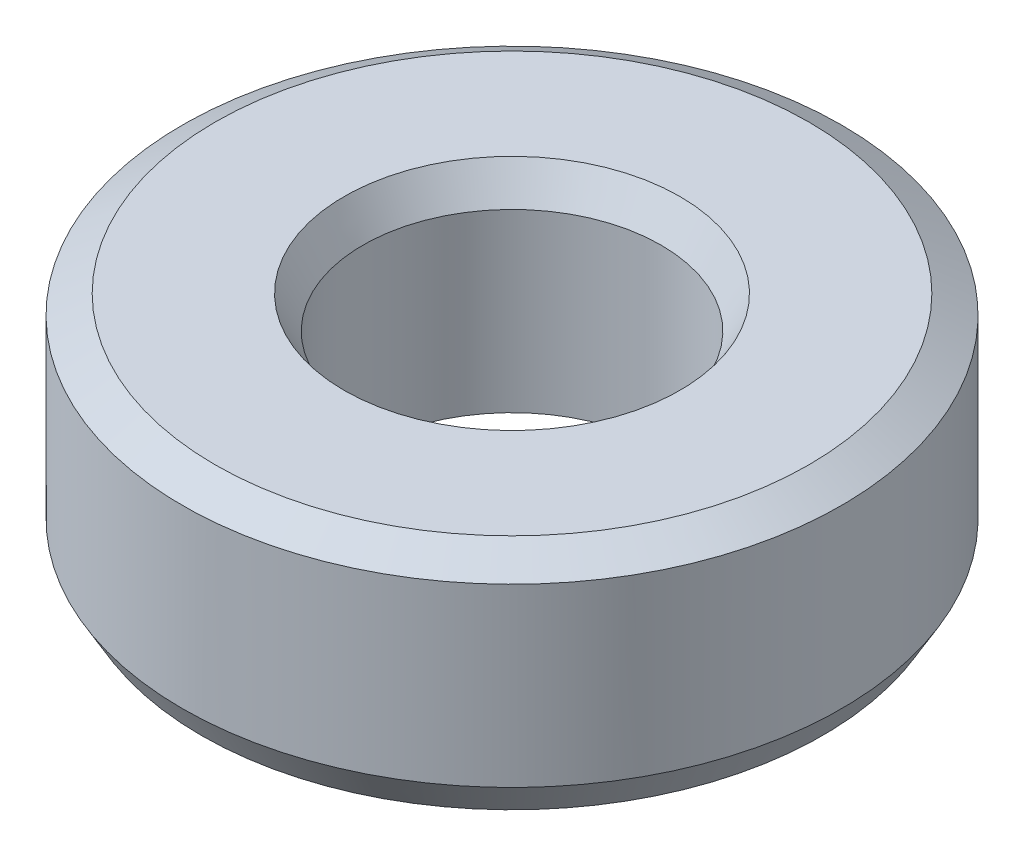
ISO-10303-21;
HEADER;
FILE_DESCRIPTION(('STEP AP214'),'2;1');
FILE_NAME('part.step','',(''),(''),'','','');
FILE_SCHEMA(('AUTOMOTIVE_DESIGN { 1 0 10303 214 1 1 1 1 }'));
ENDSEC;
DATA;
#1=APPLICATION_CONTEXT('core data for automotive mechanical design processes');
#2=APPLICATION_PROTOCOL_DEFINITION('international standard','automotive_design',2000,#1);
#3=PRODUCT_CONTEXT('',#1,'mechanical');
#4=PRODUCT('Part','Part','',(#3));
#5=PRODUCT_RELATED_PRODUCT_CATEGORY('part','',(#4));
#6=PRODUCT_DEFINITION_FORMATION('','',#4);
#7=PRODUCT_DEFINITION_CONTEXT('part definition',#1,'design');
#8=PRODUCT_DEFINITION('design','',#6,#7);
#9=PRODUCT_DEFINITION_SHAPE('','',#8);
#10=(LENGTH_UNIT() NAMED_UNIT(*) SI_UNIT(.MILLI.,.METRE.));
#11=(NAMED_UNIT(*) PLANE_ANGLE_UNIT() SI_UNIT($,.RADIAN.));
#12=(NAMED_UNIT(*) SI_UNIT($,.STERADIAN.) SOLID_ANGLE_UNIT());
#13=UNCERTAINTY_MEASURE_WITH_UNIT(LENGTH_MEASURE(1.E-05),#10,'distance_accuracy_value','');
#14=(GEOMETRIC_REPRESENTATION_CONTEXT(3) GLOBAL_UNCERTAINTY_ASSIGNED_CONTEXT((#13)) GLOBAL_UNIT_ASSIGNED_CONTEXT((#10,
#11,#12)) REPRESENTATION_CONTEXT('',''));
#15=CARTESIAN_POINT('',(0.,0.,0.));
#16=DIRECTION('',(0.,0.,1.));
#17=DIRECTION('',(1.,0.,0.));
#18=AXIS2_PLACEMENT_3D('',#15,#16,#17);
#19=CARTESIAN_POINT('',(0.,31.0685685898824,0.));
#20=DIRECTION('',(0.,-1.,0.));
#21=DIRECTION('',(0.,0.,-1.));
#22=AXIS2_PLACEMENT_3D('',#19,#20,#21);
#23=CYLINDRICAL_SURFACE('',#22,45.);
#24=CARTESIAN_POINT('',(0.,4.45937553818092,0.));
#25=DIRECTION('',(0.,1.,0.));
#26=DIRECTION('',(0.,0.,1.));
#27=AXIS2_PLACEMENT_3D('',#24,#25,#26);
#28=CIRCLE('',#27,45.);
#29=CARTESIAN_POINT('',(0.,4.45937553818092,45.));
#30=VERTEX_POINT('',#29);
#31=EDGE_CURVE('E10',#30,#30,#28,.T.);
#32=ORIENTED_EDGE('',*,*,#31,.T.);
#33=EDGE_LOOP('',(#32));
#34=FACE_BOUND('',#33,.T.);
#35=CARTESIAN_POINT('',(0.,28.493946922496,0.));
#36=DIRECTION('',(0.,1.,0.));
#37=DIRECTION('',(0.,0.,1.));
#38=AXIS2_PLACEMENT_3D('',#35,#36,#37);
#39=CIRCLE('',#38,45.);
#40=CARTESIAN_POINT('',(0.,28.493946922496,-45.));
#41=VERTEX_POINT('',#40);
#42=EDGE_CURVE('E50',#41,#41,#39,.F.);
#43=ORIENTED_EDGE('',*,*,#42,.T.);
#44=EDGE_LOOP('',(#43));
#45=FACE_BOUND('',#44,.T.);
#46=ADVANCED_FACE('F39',(#34,#45),#23,.T.);
#47=CARTESIAN_POINT('',(0.,31.0685685898824,0.));
#48=DIRECTION('',(0.,1.,0.));
#49=DIRECTION('',(0.,0.,1.));
#50=AXIS2_PLACEMENT_3D('',#47,#48,#49);
#51=PLANE('',#50);
#52=CARTESIAN_POINT('',(0.,31.0685685898824,0.));
#53=DIRECTION('',(0.,1.,0.));
#54=DIRECTION('',(0.,0.,1.));
#55=AXIS2_PLACEMENT_3D('',#52,#53,#54);
#56=CIRCLE('',#55,22.9311606808608);
#57=CARTESIAN_POINT('',(0.,31.0685685898824,22.9311606808608));
#58=VERTEX_POINT('',#57);
#59=EDGE_CURVE('E58',#58,#58,#56,.F.);
#60=ORIENTED_EDGE('',*,*,#59,.T.);
#61=EDGE_LOOP('',(#60));
#62=FACE_BOUND('',#61,.T.);
#63=CARTESIAN_POINT('',(0.,31.0685685898824,0.));
#64=DIRECTION('',(0.,1.,0.));
#65=DIRECTION('',(0.,0.,1.));
#66=AXIS2_PLACEMENT_3D('',#63,#64,#65);
#67=CIRCLE('',#66,40.540624461819);
#68=CARTESIAN_POINT('',(0.,31.0685685898824,-40.540624461819));
#69=VERTEX_POINT('',#68);
#70=EDGE_CURVE('E61',#69,#69,#67,.T.);
#71=ORIENTED_EDGE('',*,*,#70,.T.);
#72=EDGE_LOOP('',(#71));
#73=FACE_BOUND('',#72,.T.);
#74=ADVANCED_FACE('F88',(#62,#73),#51,.T.);
#75=CARTESIAN_POINT('',(0.,0.,0.));
#76=DIRECTION('',(0.,1.,0.));
#77=DIRECTION('',(0.,0.,1.));
#78=AXIS2_PLACEMENT_3D('',#75,#76,#77);
#79=PLANE('',#78);
#80=CARTESIAN_POINT('',(0.,0.,0.));
#81=DIRECTION('',(0.,1.,0.));
#82=DIRECTION('',(0.,0.,1.));
#83=AXIS2_PLACEMENT_3D('',#80,#81,#82);
#84=CIRCLE('',#83,24.8159145516553);
#85=CARTESIAN_POINT('',(0.,0.,24.8159145516553));
#86=VERTEX_POINT('',#85);
#87=EDGE_CURVE('E51',#86,#86,#84,.T.);
#88=ORIENTED_EDGE('',*,*,#87,.T.);
#89=EDGE_LOOP('',(#88));
#90=FACE_BOUND('',#89,.T.);
#91=CARTESIAN_POINT('',(0.,0.,0.));
#92=DIRECTION('',(0.,1.,0.));
#93=DIRECTION('',(0.,0.,1.));
#94=AXIS2_PLACEMENT_3D('',#91,#92,#93);
#95=CIRCLE('',#94,42.4253783326136);
#96=CARTESIAN_POINT('',(0.,0.,42.4253783326136));
#97=VERTEX_POINT('',#96);
#98=EDGE_CURVE('E54',#97,#97,#95,.F.);
#99=ORIENTED_EDGE('',*,*,#98,.T.);
#100=EDGE_LOOP('',(#99));
#101=FACE_BOUND('',#100,.T.);
#102=ADVANCED_FACE('F83',(#90,#101),#79,.F.);
#103=CARTESIAN_POINT('',(0.,31.0685685898824,0.));
#104=DIRECTION('',(0.,-1.,0.));
#105=DIRECTION('',(0.,0.,-1.));
#106=AXIS2_PLACEMENT_3D('',#103,#104,#105);
#107=CYLINDRICAL_SURFACE('',#106,20.3565390134744);
#108=CARTESIAN_POINT('',(0.,26.6091930517014,0.));
#109=DIRECTION('',(0.,1.,0.));
#110=DIRECTION('',(0.,0.,1.));
#111=AXIS2_PLACEMENT_3D('',#108,#109,#110);
#112=CIRCLE('',#111,20.3565390134744);
#113=CARTESIAN_POINT('',(0.,26.6091930517014,20.3565390134744));
#114=VERTEX_POINT('',#113);
#115=EDGE_CURVE('E67',#114,#114,#112,.T.);
#116=ORIENTED_EDGE('',*,*,#115,.T.);
#117=EDGE_LOOP('',(#116));
#118=FACE_BOUND('',#117,.T.);
#119=CARTESIAN_POINT('',(0.,2.57462166738643,0.));
#120=DIRECTION('',(0.,1.,0.));
#121=DIRECTION('',(0.,0.,1.));
#122=AXIS2_PLACEMENT_3D('',#119,#120,#121);
#123=CIRCLE('',#122,20.3565390134744);
#124=CARTESIAN_POINT('',(0.,2.57462166738643,20.3565390134744));
#125=VERTEX_POINT('',#124);
#126=EDGE_CURVE('E69',#125,#125,#123,.F.);
#127=ORIENTED_EDGE('',*,*,#126,.T.);
#128=EDGE_LOOP('',(#127));
#129=FACE_BOUND('',#128,.T.);
#130=ADVANCED_FACE('F71',(#118,#129),#107,.F.);
#131=CARTESIAN_POINT('',(0.,26.6091930517014,0.));
#132=DIRECTION('',(0.,1.,0.));
#133=DIRECTION('',(0.,0.,1.));
#134=AXIS2_PLACEMENT_3D('',#131,#132,#133);
#135=CONICAL_SURFACE('',#134,20.3565390134744,0.523598775598303);
#136=ORIENTED_EDGE('',*,*,#59,.F.);
#137=EDGE_LOOP('',(#136));
#138=FACE_BOUND('',#137,.T.);
#139=ORIENTED_EDGE('',*,*,#115,.F.);
#140=EDGE_LOOP('',(#139));
#141=FACE_BOUND('',#140,.T.);
#142=ADVANCED_FACE('F77',(#138,#141),#135,.F.);
#143=CARTESIAN_POINT('',(0.,0.,0.));
#144=DIRECTION('',(0.,-1.,0.));
#145=DIRECTION('',(0.,0.,-1.));
#146=AXIS2_PLACEMENT_3D('',#143,#144,#145);
#147=CONICAL_SURFACE('',#146,24.8159145516553,1.0471975511966);
#148=ORIENTED_EDGE('',*,*,#126,.F.);
#149=EDGE_LOOP('',(#148));
#150=FACE_BOUND('',#149,.T.);
#151=ORIENTED_EDGE('',*,*,#87,.F.);
#152=EDGE_LOOP('',(#151));
#153=FACE_BOUND('',#152,.T.);
#154=ADVANCED_FACE('F73',(#150,#153),#147,.F.);
#155=CARTESIAN_POINT('',(0.,4.45937553818092,0.));
#156=DIRECTION('',(0.,1.,0.));
#157=DIRECTION('',(0.,0.,1.));
#158=AXIS2_PLACEMENT_3D('',#155,#156,#157);
#159=CONICAL_SURFACE('',#158,45.,0.523598775598305);
#160=ORIENTED_EDGE('',*,*,#98,.F.);
#161=EDGE_LOOP('',(#160));
#162=FACE_BOUND('',#161,.T.);
#163=ORIENTED_EDGE('',*,*,#31,.F.);
#164=EDGE_LOOP('',(#163));
#165=FACE_BOUND('',#164,.T.);
#166=ADVANCED_FACE('F76',(#162,#165),#159,.T.);
#167=CARTESIAN_POINT('',(0.,31.0685685898824,0.));
#168=DIRECTION('',(0.,-1.,0.));
#169=DIRECTION('',(0.,0.,-1.));
#170=AXIS2_PLACEMENT_3D('',#167,#168,#169);
#171=CONICAL_SURFACE('',#170,40.540624461819,1.04719755119659);
#172=CARTESIAN_POINT('',(0.,28.493946922496,-45.));
#173=CARTESIAN_POINT('',(0.,28.5207658981979,-44.9535481714773));
#174=CARTESIAN_POINT('',(0.,28.5475848738998,-44.9070963429546));
#175=CARTESIAN_POINT('',(0.,28.6012228253037,-44.8141926859091));
#176=CARTESIAN_POINT('',(0.,28.6280418010057,-44.7677408573864));
#177=CARTESIAN_POINT('',(0.,28.6816797524096,-44.674837200341));
#178=CARTESIAN_POINT('',(0.,28.7084987281115,-44.6283853718183));
#179=CARTESIAN_POINT('',(0.,28.7621366795154,-44.5354817147728));
#180=CARTESIAN_POINT('',(0.,28.7889556552173,-44.4890298862501));
#181=CARTESIAN_POINT('',(0.,28.8425936066212,-44.3961262292047));
#182=CARTESIAN_POINT('',(0.,28.8694125823232,-44.3496744006819));
#183=CARTESIAN_POINT('',(0.,28.923050533727,-44.2567707436365));
#184=CARTESIAN_POINT('',(0.,28.949869509429,-44.2103189151138));
#185=CARTESIAN_POINT('',(0.,29.0035074608329,-44.1174152580684));
#186=CARTESIAN_POINT('',(0.,29.0303264365348,-44.0709634295456));
#187=CARTESIAN_POINT('',(0.,29.0839643879387,-43.9780597725002));
#188=CARTESIAN_POINT('',(0.,29.1107833636406,-43.9316079439775));
#189=CARTESIAN_POINT('',(0.,29.1644213150445,-43.838704286932));
#190=CARTESIAN_POINT('',(0.,29.1912402907465,-43.7922524584093));
#191=CARTESIAN_POINT('',(0.,29.2448782421503,-43.6993488013639));
#192=CARTESIAN_POINT('',(0.,29.2716972178523,-43.6528969728412));
#193=CARTESIAN_POINT('',(0.,29.3253351692562,-43.5599933157957));
#194=CARTESIAN_POINT('',(0.,29.3521541449581,-43.513541487273));
#195=CARTESIAN_POINT('',(0.,29.405792096362,-43.4206378302276));
#196=CARTESIAN_POINT('',(0.,29.4326110720639,-43.3741860017049));
#197=CARTESIAN_POINT('',(0.,29.4862490234678,-43.2812823446594));
#198=CARTESIAN_POINT('',(0.,29.5130679991698,-43.2348305161367));
#199=CARTESIAN_POINT('',(0.,29.5667059505736,-43.1419268590913));
#200=CARTESIAN_POINT('',(0.,29.5935249262756,-43.0954750305686));
#201=CARTESIAN_POINT('',(0.,29.6471628776795,-43.0025713735231));
#202=CARTESIAN_POINT('',(0.,29.6739818533814,-42.9561195450004));
#203=CARTESIAN_POINT('',(0.,29.7276198047853,-42.863215887955));
#204=CARTESIAN_POINT('',(0.,29.7544387804872,-42.8167640594322));
#205=CARTESIAN_POINT('',(0.,29.8080767318911,-42.7238604023868));
#206=CARTESIAN_POINT('',(0.,29.8348957075931,-42.6774085738641));
#207=CARTESIAN_POINT('',(0.,29.8885336589969,-42.5845049168187));
#208=CARTESIAN_POINT('',(0.,29.9153526346989,-42.5380530882959));
#209=CARTESIAN_POINT('',(0.,29.9689905861028,-42.4451494312505));
#210=CARTESIAN_POINT('',(0.,29.9958095618047,-42.3986976027278));
#211=CARTESIAN_POINT('',(0.,30.0494475132086,-42.3057939456823));
#212=CARTESIAN_POINT('',(0.,30.0762664889105,-42.2593421171596));
#213=CARTESIAN_POINT('',(0.,30.1299044403144,-42.1664384601142));
#214=CARTESIAN_POINT('',(0.,30.1567234160164,-42.1199866315915));
#215=CARTESIAN_POINT('',(0.,30.2103613674202,-42.027082974546));
#216=CARTESIAN_POINT('',(0.,30.2371803431222,-41.9806311460233));
#217=CARTESIAN_POINT('',(0.,30.2908182945261,-41.8877274889779));
#218=CARTESIAN_POINT('',(0.,30.317637270228,-41.8412756604552));
#219=CARTESIAN_POINT('',(0.,30.3712752216319,-41.7483720034097));
#220=CARTESIAN_POINT('',(0.,30.3980941973338,-41.701920174887));
#221=CARTESIAN_POINT('',(0.,30.4517321487377,-41.6090165178416));
#222=CARTESIAN_POINT('',(0.,30.4785511244397,-41.5625646893188));
#223=CARTESIAN_POINT('',(0.,30.5321890758436,-41.4696610322734));
#224=CARTESIAN_POINT('',(0.,30.5590080515455,-41.4232092037507));
#225=CARTESIAN_POINT('',(0.,30.6126460029494,-41.3303055467053));
#226=CARTESIAN_POINT('',(0.,30.6394649786513,-41.2838537181825));
#227=CARTESIAN_POINT('',(0.,30.6931029300552,-41.1909500611371));
#228=CARTESIAN_POINT('',(0.,30.7199219057571,-41.1444982326144));
#229=CARTESIAN_POINT('',(0.,30.773559857161,-41.0515945755689));
#230=CARTESIAN_POINT('',(0.,30.800378832863,-41.0051427470462));
#231=CARTESIAN_POINT('',(0.,30.8540167842669,-40.9122390900008));
#232=CARTESIAN_POINT('',(0.,30.8808357599688,-40.8657872614781));
#233=CARTESIAN_POINT('',(0.,30.9344737113727,-40.7728836044326));
#234=CARTESIAN_POINT('',(0.,30.9612926870746,-40.7264317759099));
#235=CARTESIAN_POINT('',(0.,31.0149306384785,-40.6335281188645));
#236=CARTESIAN_POINT('',(0.,31.0417496141804,-40.5870762903418));
#237=CARTESIAN_POINT('',(0.,31.0685685898824,-40.540624461819));
#238=B_SPLINE_CURVE_WITH_KNOTS('',3,(#172,#173,#174,#175,#176,#177,#178,#179,#180,#181,#182,
#183,#184,#185,#186,#187,#188,#189,#190,#191,#192,#193,#194,#195,#196,#197,#198,#199,#200,#201,
#202,#203,#204,#205,#206,#207,#208,#209,#210,#211,#212,#213,#214,#215,#216,#217,#218,#219,#220,
#221,#222,#223,#224,#225,#226,#227,#228,#229,#230,#231,#232,#233,#234,#235,#236,#237),
.UNSPECIFIED.,.F.,.F.,(4,2,2,2,2,2,2,2,2,2,2,2,2,2,2,2,2,2,2,2,2,2,2,2,2,2,2,2,2,2,2,2,4),(0.,
0.160913854211652,0.321827708423305,0.482741562634956,0.643655416846608,0.804569271058259,
0.965483125269911,1.12639697948156,1.28731083369321,1.44822468790487,1.60913854211652,
1.77005239632816,1.93096625053982,2.09188010475147,2.25279395896312,2.41370781317477,
2.57462166738642,2.73553552159807,2.89644937580972,3.05736323002138,3.21827708423303,
3.37919093844468,3.54010479265633,3.70101864686798,3.86193250107963,4.02284635529128,
4.18376020950293,4.34467406371458,4.50558791792623,4.66650177213789,4.82741562634954,
4.98832948056119,5.14924333477284),.UNSPECIFIED.);
#239=EDGE_CURVE('BSEAM45',#41,#69,#238,.T.);
#240=ORIENTED_EDGE('',*,*,#42,.F.);
#241=ORIENTED_EDGE('',*,*,#70,.F.);
#242=ORIENTED_EDGE('',*,*,#239,.T.);
#243=ORIENTED_EDGE('',*,*,#239,.F.);
#244=EDGE_LOOP('',(#240,#242,#241,#243));
#245=FACE_BOUND('',#244,.T.);
#246=ADVANCED_FACE('F45',(#245),#171,.T.);
#247=CLOSED_SHELL('',(#46,#74,#102,#130,#142,#154,#166,#246));
#248=MANIFOLD_SOLID_BREP('B2',#247);
#249=ADVANCED_BREP_SHAPE_REPRESENTATION('',(#18,#248),#14);
#250=SHAPE_DEFINITION_REPRESENTATION(#9,#249);
ENDSEC;
END-ISO-10303-21;
